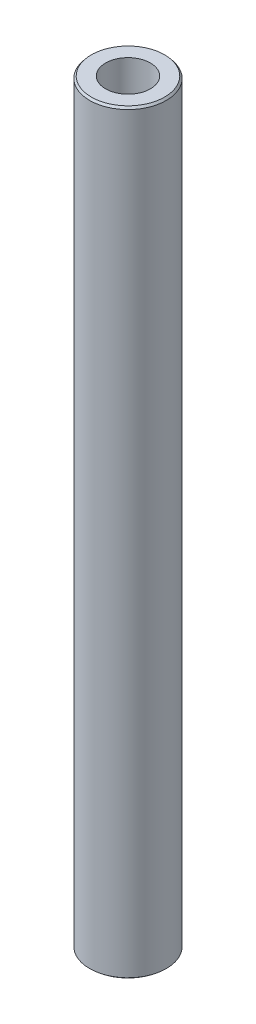
ISO-10303-21;
HEADER;
FILE_DESCRIPTION(('STEP AP214'),'2;1');
FILE_NAME('part.step','',(''),(''),'','','');
FILE_SCHEMA(('AUTOMOTIVE_DESIGN { 1 0 10303 214 1 1 1 1 }'));
ENDSEC;
DATA;
#1=APPLICATION_CONTEXT('core data for automotive mechanical design processes');
#2=APPLICATION_PROTOCOL_DEFINITION('international standard','automotive_design',2000,#1);
#3=PRODUCT_CONTEXT('',#1,'mechanical');
#4=PRODUCT('Part','Part','',(#3));
#5=PRODUCT_RELATED_PRODUCT_CATEGORY('part','',(#4));
#6=PRODUCT_DEFINITION_FORMATION('','',#4);
#7=PRODUCT_DEFINITION_CONTEXT('part definition',#1,'design');
#8=PRODUCT_DEFINITION('design','',#6,#7);
#9=PRODUCT_DEFINITION_SHAPE('','',#8);
#10=(LENGTH_UNIT() NAMED_UNIT(*) SI_UNIT(.MILLI.,.METRE.));
#11=(NAMED_UNIT(*) PLANE_ANGLE_UNIT() SI_UNIT($,.RADIAN.));
#12=(NAMED_UNIT(*) SI_UNIT($,.STERADIAN.) SOLID_ANGLE_UNIT());
#13=UNCERTAINTY_MEASURE_WITH_UNIT(LENGTH_MEASURE(1.E-05),#10,'distance_accuracy_value','');
#14=(GEOMETRIC_REPRESENTATION_CONTEXT(3) GLOBAL_UNCERTAINTY_ASSIGNED_CONTEXT((#13)) GLOBAL_UNIT_ASSIGNED_CONTEXT((#10,
#11,#12)) REPRESENTATION_CONTEXT('',''));
#15=CARTESIAN_POINT('',(0.,0.,0.));
#16=DIRECTION('',(0.,0.,1.));
#17=DIRECTION('',(1.,0.,0.));
#18=AXIS2_PLACEMENT_3D('',#15,#16,#17);
#19=CARTESIAN_POINT('',(0.,147.908068498035,0.));
#20=DIRECTION('',(0.,-1.,0.));
#21=DIRECTION('',(0.,0.,-1.));
#22=AXIS2_PLACEMENT_3D('',#19,#20,#21);
#23=CYLINDRICAL_SURFACE('',#22,7.5);
#24=CARTESIAN_POINT('',(0.,147.498924117964,0.));
#25=DIRECTION('',(0.,1.,0.));
#26=DIRECTION('',(0.,0.,1.));
#27=AXIS2_PLACEMENT_3D('',#24,#25,#26);
#28=CIRCLE('',#27,7.5);
#29=CARTESIAN_POINT('',(0.,147.498924117964,7.5));
#30=VERTEX_POINT('',#29);
#31=EDGE_CURVE('E50',#30,#30,#28,.F.);
#32=ORIENTED_EDGE('',*,*,#31,.T.);
#33=EDGE_LOOP('',(#32));
#34=FACE_BOUND('',#33,.T.);
#35=CARTESIAN_POINT('',(0.,0.326755840213938,0.));
#36=DIRECTION('',(0.,1.,0.));
#37=DIRECTION('',(0.,0.,1.));
#38=AXIS2_PLACEMENT_3D('',#35,#36,#37);
#39=CIRCLE('',#38,7.5);
#40=CARTESIAN_POINT('',(0.,0.326755840213938,7.5));
#41=VERTEX_POINT('',#40);
#42=EDGE_CURVE('E51',#41,#41,#39,.T.);
#43=ORIENTED_EDGE('',*,*,#42,.T.);
#44=EDGE_LOOP('',(#43));
#45=FACE_BOUND('',#44,.T.);
#46=ADVANCED_FACE('F39',(#34,#45),#23,.T.);
#47=CARTESIAN_POINT('',(0.,147.908068498035,0.));
#48=DIRECTION('',(0.,1.,0.));
#49=DIRECTION('',(0.,0.,1.));
#50=AXIS2_PLACEMENT_3D('',#47,#48,#49);
#51=PLANE('',#50);
#52=CARTESIAN_POINT('',(0.,147.908068498035,0.));
#53=DIRECTION('',(0.,1.,0.));
#54=DIRECTION('',(0.,0.,1.));
#55=AXIS2_PLACEMENT_3D('',#52,#53,#54);
#56=CIRCLE('',#55,7.17324415978608);
#57=CARTESIAN_POINT('',(0.,147.908068498035,7.17324415978608));
#58=VERTEX_POINT('',#57);
#59=EDGE_CURVE('E54',#58,#58,#56,.T.);
#60=ORIENTED_EDGE('',*,*,#59,.T.);
#61=EDGE_LOOP('',(#60));
#62=FACE_BOUND('',#61,.T.);
#63=CARTESIAN_POINT('',(0.,147.908068498035,0.));
#64=DIRECTION('',(0.,1.,0.));
#65=DIRECTION('',(0.,0.,1.));
#66=AXIS2_PLACEMENT_3D('',#63,#64,#65);
#67=CIRCLE('',#66,4.3902286952523);
#68=CARTESIAN_POINT('',(0.,147.908068498035,4.3902286952523));
#69=VERTEX_POINT('',#68);
#70=EDGE_CURVE('E58',#69,#69,#67,.T.);
#71=ORIENTED_EDGE('',*,*,#70,.F.);
#72=EDGE_LOOP('',(#71));
#73=FACE_BOUND('',#72,.T.);
#74=ADVANCED_FACE('F69',(#62,#73),#51,.T.);
#75=CARTESIAN_POINT('',(0.,0.,0.));
#76=DIRECTION('',(0.,1.,0.));
#77=DIRECTION('',(0.,0.,1.));
#78=AXIS2_PLACEMENT_3D('',#75,#76,#77);
#79=PLANE('',#78);
#80=CARTESIAN_POINT('',(0.,0.,0.));
#81=DIRECTION('',(0.,1.,0.));
#82=DIRECTION('',(0.,0.,1.));
#83=AXIS2_PLACEMENT_3D('',#80,#81,#82);
#84=CIRCLE('',#83,7.09085561992964);
#85=CARTESIAN_POINT('',(0.,0.,7.09085561992964));
#86=VERTEX_POINT('',#85);
#87=EDGE_CURVE('E10',#86,#86,#84,.F.);
#88=ORIENTED_EDGE('',*,*,#87,.T.);
#89=EDGE_LOOP('',(#88));
#90=FACE_BOUND('',#89,.T.);
#91=CARTESIAN_POINT('',(0.,0.,0.));
#92=DIRECTION('',(0.,1.,0.));
#93=DIRECTION('',(0.,0.,1.));
#94=AXIS2_PLACEMENT_3D('',#91,#92,#93);
#95=CIRCLE('',#94,4.3902286952523);
#96=CARTESIAN_POINT('',(0.,0.,4.3902286952523));
#97=VERTEX_POINT('',#96);
#98=EDGE_CURVE('E63',#97,#97,#95,.T.);
#99=ORIENTED_EDGE('',*,*,#98,.T.);
#100=EDGE_LOOP('',(#99));
#101=FACE_BOUND('',#100,.T.);
#102=ADVANCED_FACE('F75',(#90,#101),#79,.F.);
#103=CARTESIAN_POINT('',(0.,147.908068498035,0.));
#104=DIRECTION('',(0.,-1.,0.));
#105=DIRECTION('',(0.,0.,-1.));
#106=AXIS2_PLACEMENT_3D('',#103,#104,#105);
#107=CYLINDRICAL_SURFACE('',#106,4.3902286952523);
#108=ORIENTED_EDGE('',*,*,#70,.T.);
#109=EDGE_LOOP('',(#108));
#110=FACE_BOUND('',#109,.T.);
#111=ORIENTED_EDGE('',*,*,#98,.F.);
#112=EDGE_LOOP('',(#111));
#113=FACE_BOUND('',#112,.T.);
#114=ADVANCED_FACE('F70',(#110,#113),#107,.F.);
#115=CARTESIAN_POINT('',(0.,147.908068498035,0.));
#116=DIRECTION('',(0.,-1.,0.));
#117=DIRECTION('',(0.,0.,-1.));
#118=AXIS2_PLACEMENT_3D('',#115,#116,#117);
#119=CONICAL_SURFACE('',#118,7.17324415978608,0.673906307217323);
#120=ORIENTED_EDGE('',*,*,#31,.F.);
#121=EDGE_LOOP('',(#120));
#122=FACE_BOUND('',#121,.T.);
#123=ORIENTED_EDGE('',*,*,#59,.F.);
#124=EDGE_LOOP('',(#123));
#125=FACE_BOUND('',#124,.T.);
#126=ADVANCED_FACE('F81',(#122,#125),#119,.T.);
#127=CARTESIAN_POINT('',(0.,0.326755840213938,0.));
#128=DIRECTION('',(0.,1.,0.));
#129=DIRECTION('',(0.,0.,1.));
#130=AXIS2_PLACEMENT_3D('',#127,#128,#129);
#131=CONICAL_SURFACE('',#130,7.5,0.896890019577568);
#132=ORIENTED_EDGE('',*,*,#87,.F.);
#133=EDGE_LOOP('',(#132));
#134=FACE_BOUND('',#133,.T.);
#135=ORIENTED_EDGE('',*,*,#42,.F.);
#136=EDGE_LOOP('',(#135));
#137=FACE_BOUND('',#136,.T.);
#138=ADVANCED_FACE('F45',(#134,#137),#131,.T.);
#139=CLOSED_SHELL('',(#46,#74,#102,#114,#126,#138));
#140=MANIFOLD_SOLID_BREP('B2',#139);
#141=ADVANCED_BREP_SHAPE_REPRESENTATION('',(#18,#140),#14);
#142=SHAPE_DEFINITION_REPRESENTATION(#9,#141);
ENDSEC;
END-ISO-10303-21;
